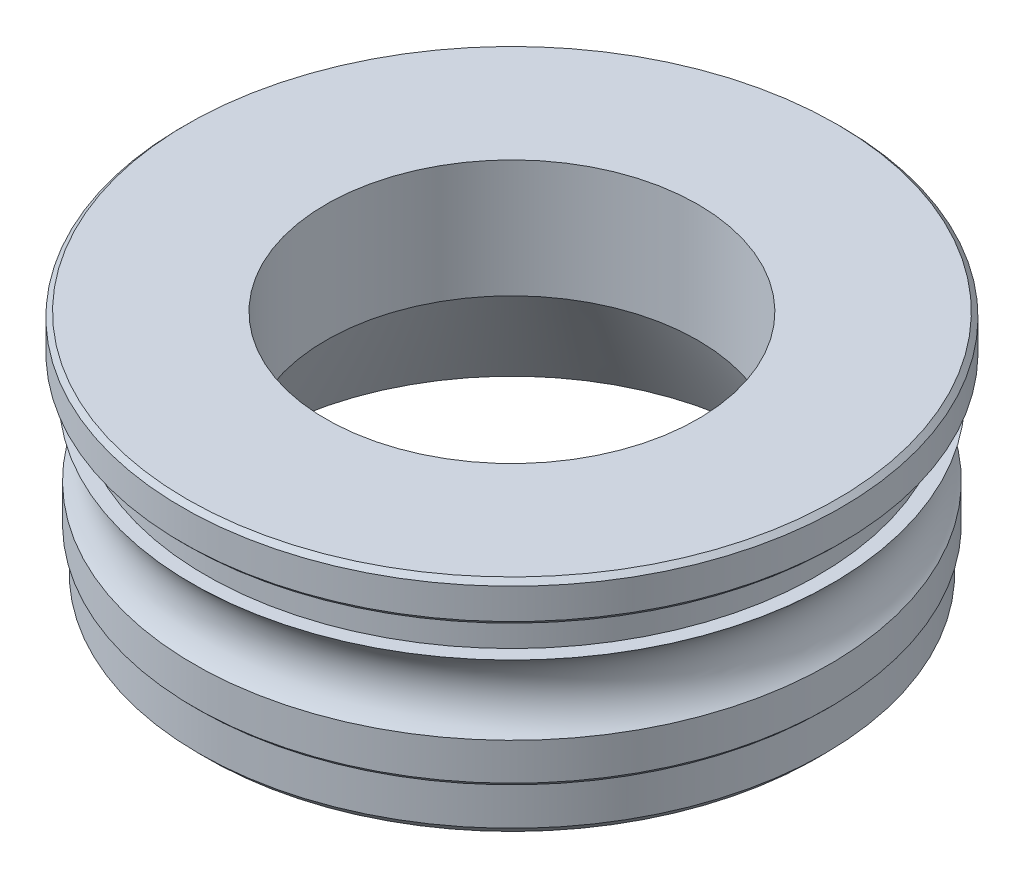
ISO-10303-21;
HEADER;
FILE_DESCRIPTION(('STEP AP214'),'2;1');
FILE_NAME('part.step','',(''),(''),'','','');
FILE_SCHEMA(('AUTOMOTIVE_DESIGN { 1 0 10303 214 1 1 1 1 }'));
ENDSEC;
DATA;
#1=APPLICATION_CONTEXT('core data for automotive mechanical design processes');
#2=APPLICATION_PROTOCOL_DEFINITION('international standard','automotive_design',2000,#1);
#3=PRODUCT_CONTEXT('',#1,'mechanical');
#4=PRODUCT('Part','Part','',(#3));
#5=PRODUCT_RELATED_PRODUCT_CATEGORY('part','',(#4));
#6=PRODUCT_DEFINITION_FORMATION('','',#4);
#7=PRODUCT_DEFINITION_CONTEXT('part definition',#1,'design');
#8=PRODUCT_DEFINITION('design','',#6,#7);
#9=PRODUCT_DEFINITION_SHAPE('','',#8);
#10=(LENGTH_UNIT() NAMED_UNIT(*) SI_UNIT(.MILLI.,.METRE.));
#11=(NAMED_UNIT(*) PLANE_ANGLE_UNIT() SI_UNIT($,.RADIAN.));
#12=(NAMED_UNIT(*) SI_UNIT($,.STERADIAN.) SOLID_ANGLE_UNIT());
#13=UNCERTAINTY_MEASURE_WITH_UNIT(LENGTH_MEASURE(1.E-05),#10,'distance_accuracy_value','');
#14=(GEOMETRIC_REPRESENTATION_CONTEXT(3) GLOBAL_UNCERTAINTY_ASSIGNED_CONTEXT((#13)) GLOBAL_UNIT_ASSIGNED_CONTEXT((#10,
#11,#12)) REPRESENTATION_CONTEXT('',''));
#15=CARTESIAN_POINT('',(0.,0.,0.));
#16=DIRECTION('',(0.,0.,1.));
#17=DIRECTION('',(1.,0.,0.));
#18=AXIS2_PLACEMENT_3D('',#15,#16,#17);
#19=CARTESIAN_POINT('',(5.39337567297407,0.,0.));
#20=DIRECTION('',(0.,-1.,0.));
#21=DIRECTION('',(0.,0.,-1.));
#22=AXIS2_PLACEMENT_3D('',#19,#20,#21);
#23=PLANE('',#22);
#24=CARTESIAN_POINT('',(0.,0.,0.));
#25=DIRECTION('',(0.,-1.,0.));
#26=DIRECTION('',(0.,0.,-1.));
#27=AXIS2_PLACEMENT_3D('',#24,#25,#26);
#28=CIRCLE('',#27,6.45);
#29=CARTESIAN_POINT('',(0.,0.,-6.45));
#30=VERTEX_POINT('',#29);
#31=EDGE_CURVE('E99',#30,#30,#28,.T.);
#32=ORIENTED_EDGE('',*,*,#31,.T.);
#33=EDGE_LOOP('',(#32));
#34=FACE_BOUND('',#33,.T.);
#35=CARTESIAN_POINT('',(0.,0.,0.));
#36=DIRECTION('',(0.,-1.,0.));
#37=DIRECTION('',(0.,0.,-1.));
#38=AXIS2_PLACEMENT_3D('',#35,#36,#37);
#39=CIRCLE('',#38,5.39337567297407);
#40=CARTESIAN_POINT('',(0.,0.,-5.39337567297407));
#41=VERTEX_POINT('',#40);
#42=EDGE_CURVE('E10',#41,#41,#39,.T.);
#43=ORIENTED_EDGE('',*,*,#42,.F.);
#44=EDGE_LOOP('',(#43));
#45=FACE_BOUND('',#44,.T.);
#46=ADVANCED_FACE('F36',(#34,#45),#23,.T.);
#47=CARTESIAN_POINT('',(0.,2.5,0.));
#48=DIRECTION('',(0.,-1.,0.));
#49=DIRECTION('',(0.,0.,-1.));
#50=AXIS2_PLACEMENT_3D('',#47,#48,#49);
#51=CONICAL_SURFACE('',#50,3.95,0.523598775598301);
#52=ORIENTED_EDGE('',*,*,#42,.T.);
#53=EDGE_LOOP('',(#52));
#54=FACE_BOUND('',#53,.T.);
#55=CARTESIAN_POINT('',(0.,2.5,0.));
#56=DIRECTION('',(0.,-1.,0.));
#57=DIRECTION('',(0.,0.,-1.));
#58=AXIS2_PLACEMENT_3D('',#55,#56,#57);
#59=CIRCLE('',#58,3.95);
#60=CARTESIAN_POINT('',(0.,2.5,-3.95));
#61=VERTEX_POINT('',#60);
#62=EDGE_CURVE('E43',#61,#61,#59,.T.);
#63=ORIENTED_EDGE('',*,*,#62,.F.);
#64=EDGE_LOOP('',(#63));
#65=FACE_BOUND('',#64,.T.);
#66=ADVANCED_FACE('F118',(#54,#65),#51,.F.);
#67=CARTESIAN_POINT('',(0.,0.,0.));
#68=DIRECTION('',(0.,-1.,0.));
#69=DIRECTION('',(0.,0.,-1.));
#70=AXIS2_PLACEMENT_3D('',#67,#68,#69);
#71=CYLINDRICAL_SURFACE('',#70,3.95);
#72=ORIENTED_EDGE('',*,*,#62,.T.);
#73=EDGE_LOOP('',(#72));
#74=FACE_BOUND('',#73,.T.);
#75=CARTESIAN_POINT('',(0.,5.,0.));
#76=DIRECTION('',(0.,-1.,0.));
#77=DIRECTION('',(0.,0.,-1.));
#78=AXIS2_PLACEMENT_3D('',#75,#76,#77);
#79=CIRCLE('',#78,3.95);
#80=CARTESIAN_POINT('',(0.,5.,-3.95));
#81=VERTEX_POINT('',#80);
#82=EDGE_CURVE('E50',#81,#81,#79,.T.);
#83=ORIENTED_EDGE('',*,*,#82,.F.);
#84=EDGE_LOOP('',(#83));
#85=FACE_BOUND('',#84,.T.);
#86=ADVANCED_FACE('F122',(#74,#85),#71,.F.);
#87=CARTESIAN_POINT('',(3.95,5.,0.));
#88=DIRECTION('',(0.,1.,0.));
#89=DIRECTION('',(0.,0.,1.));
#90=AXIS2_PLACEMENT_3D('',#87,#88,#89);
#91=PLANE('',#90);
#92=ORIENTED_EDGE('',*,*,#82,.T.);
#93=EDGE_LOOP('',(#92));
#94=FACE_BOUND('',#93,.T.);
#95=CARTESIAN_POINT('',(0.,5.,0.));
#96=DIRECTION('',(0.,-1.,0.));
#97=DIRECTION('',(0.,0.,-1.));
#98=AXIS2_PLACEMENT_3D('',#95,#96,#97);
#99=CIRCLE('',#98,6.9);
#100=CARTESIAN_POINT('',(0.,5.,-6.9));
#101=VERTEX_POINT('',#100);
#102=EDGE_CURVE('E55',#101,#101,#99,.T.);
#103=ORIENTED_EDGE('',*,*,#102,.F.);
#104=EDGE_LOOP('',(#103));
#105=FACE_BOUND('',#104,.T.);
#106=ADVANCED_FACE('F126',(#94,#105),#91,.T.);
#107=CARTESIAN_POINT('',(0.,4.9,0.));
#108=DIRECTION('',(0.,-1.,0.));
#109=DIRECTION('',(0.,0.,-1.));
#110=AXIS2_PLACEMENT_3D('',#107,#108,#109);
#111=CONICAL_SURFACE('',#110,7.,0.785398163397448);
#112=ORIENTED_EDGE('',*,*,#102,.T.);
#113=EDGE_LOOP('',(#112));
#114=FACE_BOUND('',#113,.T.);
#115=CARTESIAN_POINT('',(0.,4.9,0.));
#116=DIRECTION('',(0.,-1.,0.));
#117=DIRECTION('',(0.,0.,-1.));
#118=AXIS2_PLACEMENT_3D('',#115,#116,#117);
#119=CIRCLE('',#118,7.);
#120=CARTESIAN_POINT('',(0.,4.9,-7.));
#121=VERTEX_POINT('',#120);
#122=EDGE_CURVE('E61',#121,#121,#119,.T.);
#123=ORIENTED_EDGE('',*,*,#122,.F.);
#124=EDGE_LOOP('',(#123));
#125=FACE_BOUND('',#124,.T.);
#126=ADVANCED_FACE('F132',(#114,#125),#111,.T.);
#127=CARTESIAN_POINT('',(0.,0.,0.));
#128=DIRECTION('',(0.,-1.,0.));
#129=DIRECTION('',(0.,0.,-1.));
#130=AXIS2_PLACEMENT_3D('',#127,#128,#129);
#131=CYLINDRICAL_SURFACE('',#130,7.);
#132=ORIENTED_EDGE('',*,*,#122,.T.);
#133=EDGE_LOOP('',(#132));
#134=FACE_BOUND('',#133,.T.);
#135=CARTESIAN_POINT('',(0.,4.25,0.));
#136=DIRECTION('',(0.,-1.,0.));
#137=DIRECTION('',(0.,0.,-1.));
#138=AXIS2_PLACEMENT_3D('',#135,#136,#137);
#139=CIRCLE('',#138,7.);
#140=CARTESIAN_POINT('',(0.,4.25,-7.));
#141=VERTEX_POINT('',#140);
#142=EDGE_CURVE('E65',#141,#141,#139,.T.);
#143=ORIENTED_EDGE('',*,*,#142,.F.);
#144=EDGE_LOOP('',(#143));
#145=FACE_BOUND('',#144,.T.);
#146=ADVANCED_FACE('F136',(#134,#145),#131,.T.);
#147=CARTESIAN_POINT('',(0.,4.15,0.));
#148=DIRECTION('',(0.,1.,0.));
#149=DIRECTION('',(0.,0.,1.));
#150=AXIS2_PLACEMENT_3D('',#147,#148,#149);
#151=CONICAL_SURFACE('',#150,6.9,0.785398163397448);
#152=ORIENTED_EDGE('',*,*,#142,.T.);
#153=EDGE_LOOP('',(#152));
#154=FACE_BOUND('',#153,.T.);
#155=CARTESIAN_POINT('',(0.,4.15,0.));
#156=DIRECTION('',(0.,-1.,0.));
#157=DIRECTION('',(0.,0.,-1.));
#158=AXIS2_PLACEMENT_3D('',#155,#156,#157);
#159=CIRCLE('',#158,6.9);
#160=CARTESIAN_POINT('',(0.,4.15,-6.9));
#161=VERTEX_POINT('',#160);
#162=EDGE_CURVE('E69',#161,#161,#159,.T.);
#163=ORIENTED_EDGE('',*,*,#162,.F.);
#164=EDGE_LOOP('',(#163));
#165=FACE_BOUND('',#164,.T.);
#166=ADVANCED_FACE('F140',(#154,#165),#151,.T.);
#167=CARTESIAN_POINT('',(6.9,4.15,0.));
#168=DIRECTION('',(0.,-1.,0.));
#169=DIRECTION('',(0.,0.,-1.));
#170=AXIS2_PLACEMENT_3D('',#167,#168,#169);
#171=PLANE('',#170);
#172=ORIENTED_EDGE('',*,*,#162,.T.);
#173=EDGE_LOOP('',(#172));
#174=FACE_BOUND('',#173,.T.);
#175=CARTESIAN_POINT('',(0.,4.15,0.));
#176=DIRECTION('',(0.,-1.,0.));
#177=DIRECTION('',(0.,0.,-1.));
#178=AXIS2_PLACEMENT_3D('',#175,#176,#177);
#179=CIRCLE('',#178,6.5);
#180=CARTESIAN_POINT('',(0.,4.15,-6.5));
#181=VERTEX_POINT('',#180);
#182=EDGE_CURVE('E73',#181,#181,#179,.T.);
#183=ORIENTED_EDGE('',*,*,#182,.F.);
#184=EDGE_LOOP('',(#183));
#185=FACE_BOUND('',#184,.T.);
#186=ADVANCED_FACE('F144',(#174,#185),#171,.T.);
#187=CARTESIAN_POINT('',(0.,0.,0.));
#188=DIRECTION('',(0.,-1.,0.));
#189=DIRECTION('',(0.,0.,-1.));
#190=AXIS2_PLACEMENT_3D('',#187,#188,#189);
#191=CYLINDRICAL_SURFACE('',#190,6.5);
#192=ORIENTED_EDGE('',*,*,#182,.T.);
#193=EDGE_LOOP('',(#192));
#194=FACE_BOUND('',#193,.T.);
#195=CARTESIAN_POINT('',(0.,3.4,0.));
#196=DIRECTION('',(0.,-1.,0.));
#197=DIRECTION('',(0.,0.,-1.));
#198=AXIS2_PLACEMENT_3D('',#195,#196,#197);
#199=CIRCLE('',#198,6.5);
#200=CARTESIAN_POINT('',(0.,3.4,-6.5));
#201=VERTEX_POINT('',#200);
#202=EDGE_CURVE('E77',#201,#201,#199,.T.);
#203=ORIENTED_EDGE('',*,*,#202,.F.);
#204=EDGE_LOOP('',(#203));
#205=FACE_BOUND('',#204,.T.);
#206=ADVANCED_FACE('F148',(#194,#205),#191,.T.);
#207=CARTESIAN_POINT('',(6.5,3.4,0.));
#208=DIRECTION('',(0.,1.,0.));
#209=DIRECTION('',(0.,0.,1.));
#210=AXIS2_PLACEMENT_3D('',#207,#208,#209);
#211=PLANE('',#210);
#212=ORIENTED_EDGE('',*,*,#202,.T.);
#213=EDGE_LOOP('',(#212));
#214=FACE_BOUND('',#213,.T.);
#215=CARTESIAN_POINT('',(0.,3.4,0.));
#216=DIRECTION('',(0.,-1.,0.));
#217=DIRECTION('',(0.,0.,-1.));
#218=AXIS2_PLACEMENT_3D('',#215,#216,#217);
#219=CIRCLE('',#218,6.8);
#220=CARTESIAN_POINT('',(0.,3.4,-6.8));
#221=VERTEX_POINT('',#220);
#222=EDGE_CURVE('E80',#221,#221,#219,.T.);
#223=ORIENTED_EDGE('',*,*,#222,.F.);
#224=EDGE_LOOP('',(#223));
#225=FACE_BOUND('',#224,.T.);
#226=ADVANCED_FACE('F152',(#214,#225),#211,.T.);
#227=CARTESIAN_POINT('',(0.,2.62284833400189,0.));
#228=DIRECTION('',(0.,-1.,0.));
#229=DIRECTION('',(0.,0.,-1.));
#230=AXIS2_PLACEMENT_3D('',#227,#228,#229);
#231=TOROIDAL_SURFACE('',#230,7.42931334646292,1.);
#232=ORIENTED_EDGE('',*,*,#222,.T.);
#233=EDGE_LOOP('',(#232));
#234=FACE_BOUND('',#233,.T.);
#235=CARTESIAN_POINT('',(0.,1.889,0.));
#236=DIRECTION('',(0.,-1.,0.));
#237=DIRECTION('',(0.,0.,-1.));
#238=AXIS2_PLACEMENT_3D('',#235,#236,#237);
#239=CIRCLE('',#238,6.75);
#240=CARTESIAN_POINT('',(0.,1.889,-6.75));
#241=VERTEX_POINT('',#240);
#242=EDGE_CURVE('E84',#241,#241,#239,.T.);
#243=ORIENTED_EDGE('',*,*,#242,.F.);
#244=EDGE_LOOP('',(#243));
#245=FACE_BOUND('',#244,.T.);
#246=ADVANCED_FACE('F156',(#234,#245),#231,.F.);
#247=CARTESIAN_POINT('',(0.,0.,0.));
#248=DIRECTION('',(0.,-1.,0.));
#249=DIRECTION('',(0.,0.,-1.));
#250=AXIS2_PLACEMENT_3D('',#247,#248,#249);
#251=CYLINDRICAL_SURFACE('',#250,6.75);
#252=ORIENTED_EDGE('',*,*,#242,.T.);
#253=EDGE_LOOP('',(#252));
#254=FACE_BOUND('',#253,.T.);
#255=CARTESIAN_POINT('',(0.,1.1,0.));
#256=DIRECTION('',(0.,-1.,0.));
#257=DIRECTION('',(0.,0.,-1.));
#258=AXIS2_PLACEMENT_3D('',#255,#256,#257);
#259=CIRCLE('',#258,6.75);
#260=CARTESIAN_POINT('',(0.,1.1,-6.75));
#261=VERTEX_POINT('',#260);
#262=EDGE_CURVE('E87',#261,#261,#259,.T.);
#263=ORIENTED_EDGE('',*,*,#262,.F.);
#264=EDGE_LOOP('',(#263));
#265=FACE_BOUND('',#264,.T.);
#266=ADVANCED_FACE('F160',(#254,#265),#251,.T.);
#267=CARTESIAN_POINT('',(0.,1.,0.));
#268=DIRECTION('',(0.,1.,0.));
#269=DIRECTION('',(0.,0.,1.));
#270=AXIS2_PLACEMENT_3D('',#267,#268,#269);
#271=CONICAL_SURFACE('',#270,6.65,0.785398163397441);
#272=ORIENTED_EDGE('',*,*,#262,.T.);
#273=EDGE_LOOP('',(#272));
#274=FACE_BOUND('',#273,.T.);
#275=CARTESIAN_POINT('',(0.,1.,0.));
#276=DIRECTION('',(0.,-1.,0.));
#277=DIRECTION('',(0.,0.,-1.));
#278=AXIS2_PLACEMENT_3D('',#275,#276,#277);
#279=CIRCLE('',#278,6.65);
#280=CARTESIAN_POINT('',(0.,1.,-6.65));
#281=VERTEX_POINT('',#280);
#282=EDGE_CURVE('E91',#281,#281,#279,.T.);
#283=ORIENTED_EDGE('',*,*,#282,.F.);
#284=EDGE_LOOP('',(#283));
#285=FACE_BOUND('',#284,.T.);
#286=ADVANCED_FACE('F114',(#274,#285),#271,.T.);
#287=CARTESIAN_POINT('',(0.,0.,0.));
#288=DIRECTION('',(0.,-1.,0.));
#289=DIRECTION('',(0.,0.,-1.));
#290=AXIS2_PLACEMENT_3D('',#287,#288,#289);
#291=CYLINDRICAL_SURFACE('',#290,6.65);
#292=ORIENTED_EDGE('',*,*,#282,.T.);
#293=EDGE_LOOP('',(#292));
#294=FACE_BOUND('',#293,.T.);
#295=CARTESIAN_POINT('',(0.,0.2,0.));
#296=DIRECTION('',(0.,-1.,0.));
#297=DIRECTION('',(0.,0.,-1.));
#298=AXIS2_PLACEMENT_3D('',#295,#296,#297);
#299=CIRCLE('',#298,6.65);
#300=CARTESIAN_POINT('',(0.,0.2,-6.65));
#301=VERTEX_POINT('',#300);
#302=EDGE_CURVE('E95',#301,#301,#299,.T.);
#303=ORIENTED_EDGE('',*,*,#302,.F.);
#304=EDGE_LOOP('',(#303));
#305=FACE_BOUND('',#304,.T.);
#306=ADVANCED_FACE('F108',(#294,#305),#291,.T.);
#307=CARTESIAN_POINT('',(0.,0.,0.));
#308=DIRECTION('',(0.,1.,0.));
#309=DIRECTION('',(0.,0.,1.));
#310=AXIS2_PLACEMENT_3D('',#307,#308,#309);
#311=CONICAL_SURFACE('',#310,6.45,0.785398163397443);
#312=ORIENTED_EDGE('',*,*,#302,.T.);
#313=EDGE_LOOP('',(#312));
#314=FACE_BOUND('',#313,.T.);
#315=ORIENTED_EDGE('',*,*,#31,.F.);
#316=EDGE_LOOP('',(#315));
#317=FACE_BOUND('',#316,.T.);
#318=ADVANCED_FACE('F106',(#314,#317),#311,.T.);
#319=CLOSED_SHELL('',(#46,#66,#86,#106,#126,#146,#166,#186,#206,#226,#246,#266,#286,#306,#318));
#320=MANIFOLD_SOLID_BREP('B2',#319);
#321=ADVANCED_BREP_SHAPE_REPRESENTATION('',(#18,#320),#14);
#322=SHAPE_DEFINITION_REPRESENTATION(#9,#321);
ENDSEC;
END-ISO-10303-21;
